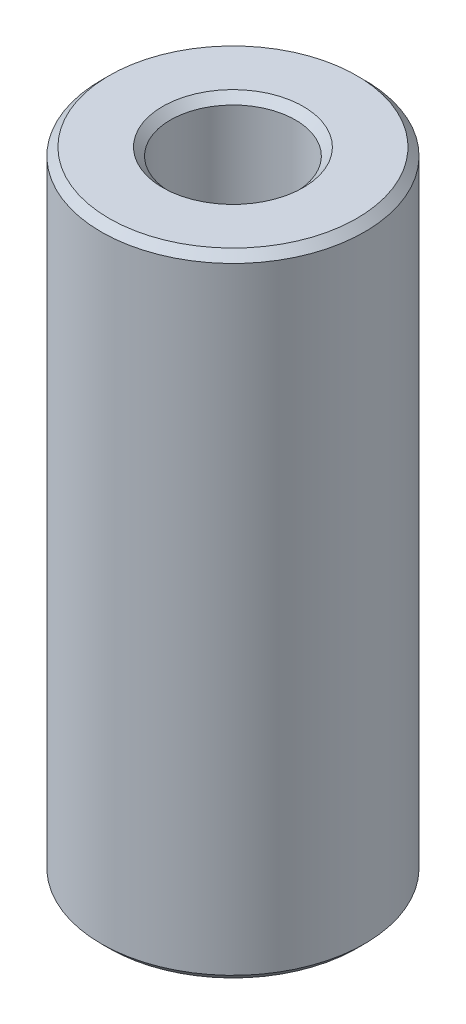
ISO-10303-21;
HEADER;
FILE_DESCRIPTION(('STEP AP214'),'2;1');
FILE_NAME('part.step','',(''),(''),'','','');
FILE_SCHEMA(('AUTOMOTIVE_DESIGN { 1 0 10303 214 1 1 1 1 }'));
ENDSEC;
DATA;
#1=APPLICATION_CONTEXT('core data for automotive mechanical design processes');
#2=APPLICATION_PROTOCOL_DEFINITION('international standard','automotive_design',2000,#1);
#3=PRODUCT_CONTEXT('',#1,'mechanical');
#4=PRODUCT('Part','Part','',(#3));
#5=PRODUCT_RELATED_PRODUCT_CATEGORY('part','',(#4));
#6=PRODUCT_DEFINITION_FORMATION('','',#4);
#7=PRODUCT_DEFINITION_CONTEXT('part definition',#1,'design');
#8=PRODUCT_DEFINITION('design','',#6,#7);
#9=PRODUCT_DEFINITION_SHAPE('','',#8);
#10=(LENGTH_UNIT() NAMED_UNIT(*) SI_UNIT(.MILLI.,.METRE.));
#11=(NAMED_UNIT(*) PLANE_ANGLE_UNIT() SI_UNIT($,.RADIAN.));
#12=(NAMED_UNIT(*) SI_UNIT($,.STERADIAN.) SOLID_ANGLE_UNIT());
#13=UNCERTAINTY_MEASURE_WITH_UNIT(LENGTH_MEASURE(1.E-05),#10,'distance_accuracy_value','');
#14=(GEOMETRIC_REPRESENTATION_CONTEXT(3) GLOBAL_UNCERTAINTY_ASSIGNED_CONTEXT((#13)) GLOBAL_UNIT_ASSIGNED_CONTEXT((#10,
#11,#12)) REPRESENTATION_CONTEXT('',''));
#15=CARTESIAN_POINT('',(0.,0.,0.));
#16=DIRECTION('',(0.,0.,1.));
#17=DIRECTION('',(1.,0.,0.));
#18=AXIS2_PLACEMENT_3D('',#15,#16,#17);
#19=CARTESIAN_POINT('',(0.,252.163192354526,0.));
#20=DIRECTION('',(0.,-1.,0.));
#21=DIRECTION('',(0.,0.,-1.));
#22=AXIS2_PLACEMENT_3D('',#19,#20,#21);
#23=CYLINDRICAL_SURFACE('',#22,52.5);
#24=CARTESIAN_POINT('',(0.,3.11576420458826,0.));
#25=DIRECTION('',(0.,1.,0.));
#26=DIRECTION('',(0.,0.,1.));
#27=AXIS2_PLACEMENT_3D('',#24,#25,#26);
#28=CIRCLE('',#27,52.5);
#29=CARTESIAN_POINT('',(0.,3.11576420458826,52.5));
#30=VERTEX_POINT('',#29);
#31=EDGE_CURVE('E10',#30,#30,#28,.T.);
#32=ORIENTED_EDGE('',*,*,#31,.T.);
#33=EDGE_LOOP('',(#32));
#34=FACE_BOUND('',#33,.T.);
#35=CARTESIAN_POINT('',(0.,249.047428149937,0.));
#36=DIRECTION('',(0.,1.,0.));
#37=DIRECTION('',(0.,0.,1.));
#38=AXIS2_PLACEMENT_3D('',#35,#36,#37);
#39=CIRCLE('',#38,52.5);
#40=CARTESIAN_POINT('',(0.,249.047428149937,52.5));
#41=VERTEX_POINT('',#40);
#42=EDGE_CURVE('E50',#41,#41,#39,.F.);
#43=ORIENTED_EDGE('',*,*,#42,.T.);
#44=EDGE_LOOP('',(#43));
#45=FACE_BOUND('',#44,.T.);
#46=ADVANCED_FACE('F39',(#34,#45),#23,.T.);
#47=CARTESIAN_POINT('',(0.,252.163192354526,0.));
#48=DIRECTION('',(0.,1.,0.));
#49=DIRECTION('',(0.,0.,1.));
#50=AXIS2_PLACEMENT_3D('',#47,#48,#49);
#51=PLANE('',#50);
#52=CARTESIAN_POINT('',(0.,252.163192354526,0.));
#53=DIRECTION('',(0.,1.,0.));
#54=DIRECTION('',(0.,0.,1.));
#55=AXIS2_PLACEMENT_3D('',#52,#53,#54);
#56=CIRCLE('',#55,28.0629586832944);
#57=CARTESIAN_POINT('',(0.,252.163192354526,28.0629586832944));
#58=VERTEX_POINT('',#57);
#59=EDGE_CURVE('E58',#58,#58,#56,.F.);
#60=ORIENTED_EDGE('',*,*,#59,.T.);
#61=EDGE_LOOP('',(#60));
#62=FACE_BOUND('',#61,.T.);
#63=CARTESIAN_POINT('',(0.,252.163192354526,0.));
#64=DIRECTION('',(0.,1.,0.));
#65=DIRECTION('',(0.,0.,1.));
#66=AXIS2_PLACEMENT_3D('',#63,#64,#65);
#67=CIRCLE('',#66,49.3842357954117);
#68=CARTESIAN_POINT('',(0.,252.163192354526,49.3842357954117));
#69=VERTEX_POINT('',#68);
#70=EDGE_CURVE('E61',#69,#69,#67,.T.);
#71=ORIENTED_EDGE('',*,*,#70,.T.);
#72=EDGE_LOOP('',(#71));
#73=FACE_BOUND('',#72,.T.);
#74=ADVANCED_FACE('F88',(#62,#73),#51,.T.);
#75=CARTESIAN_POINT('',(0.,0.,0.));
#76=DIRECTION('',(0.,1.,0.));
#77=DIRECTION('',(0.,0.,1.));
#78=AXIS2_PLACEMENT_3D('',#75,#76,#77);
#79=PLANE('',#78);
#80=CARTESIAN_POINT('',(0.,0.,0.));
#81=DIRECTION('',(0.,1.,0.));
#82=DIRECTION('',(0.,0.,1.));
#83=AXIS2_PLACEMENT_3D('',#80,#81,#82);
#84=CIRCLE('',#83,28.0629586832944);
#85=CARTESIAN_POINT('',(0.,0.,28.0629586832944));
#86=VERTEX_POINT('',#85);
#87=EDGE_CURVE('E51',#86,#86,#84,.T.);
#88=ORIENTED_EDGE('',*,*,#87,.T.);
#89=EDGE_LOOP('',(#88));
#90=FACE_BOUND('',#89,.T.);
#91=CARTESIAN_POINT('',(0.,0.,0.));
#92=DIRECTION('',(0.,1.,0.));
#93=DIRECTION('',(0.,0.,1.));
#94=AXIS2_PLACEMENT_3D('',#91,#92,#93);
#95=CIRCLE('',#94,49.3842357954117);
#96=CARTESIAN_POINT('',(0.,0.,49.3842357954117));
#97=VERTEX_POINT('',#96);
#98=EDGE_CURVE('E54',#97,#97,#95,.F.);
#99=ORIENTED_EDGE('',*,*,#98,.T.);
#100=EDGE_LOOP('',(#99));
#101=FACE_BOUND('',#100,.T.);
#102=ADVANCED_FACE('F83',(#90,#101),#79,.F.);
#103=CARTESIAN_POINT('',(0.,252.163192354526,0.));
#104=DIRECTION('',(0.,-1.,0.));
#105=DIRECTION('',(0.,0.,-1.));
#106=AXIS2_PLACEMENT_3D('',#103,#104,#105);
#107=CYLINDRICAL_SURFACE('',#106,24.9471944787061);
#108=CARTESIAN_POINT('',(0.,249.047428149937,0.));
#109=DIRECTION('',(0.,1.,0.));
#110=DIRECTION('',(0.,0.,1.));
#111=AXIS2_PLACEMENT_3D('',#108,#109,#110);
#112=CIRCLE('',#111,24.9471944787061);
#113=CARTESIAN_POINT('',(0.,249.047428149937,24.9471944787061));
#114=VERTEX_POINT('',#113);
#115=EDGE_CURVE('E67',#114,#114,#112,.T.);
#116=ORIENTED_EDGE('',*,*,#115,.T.);
#117=EDGE_LOOP('',(#116));
#118=FACE_BOUND('',#117,.T.);
#119=CARTESIAN_POINT('',(0.,3.11576420458831,0.));
#120=DIRECTION('',(0.,1.,0.));
#121=DIRECTION('',(0.,0.,1.));
#122=AXIS2_PLACEMENT_3D('',#119,#120,#121);
#123=CIRCLE('',#122,24.9471944787061);
#124=CARTESIAN_POINT('',(0.,3.11576420458831,24.9471944787061));
#125=VERTEX_POINT('',#124);
#126=EDGE_CURVE('E69',#125,#125,#123,.F.);
#127=ORIENTED_EDGE('',*,*,#126,.T.);
#128=EDGE_LOOP('',(#127));
#129=FACE_BOUND('',#128,.T.);
#130=ADVANCED_FACE('F71',(#118,#129),#107,.F.);
#131=CARTESIAN_POINT('',(0.,249.047428149937,0.));
#132=DIRECTION('',(0.,1.,0.));
#133=DIRECTION('',(0.,0.,1.));
#134=AXIS2_PLACEMENT_3D('',#131,#132,#133);
#135=CONICAL_SURFACE('',#134,24.9471944787061,0.78539816339745);
#136=ORIENTED_EDGE('',*,*,#59,.F.);
#137=EDGE_LOOP('',(#136));
#138=FACE_BOUND('',#137,.T.);
#139=ORIENTED_EDGE('',*,*,#115,.F.);
#140=EDGE_LOOP('',(#139));
#141=FACE_BOUND('',#140,.T.);
#142=ADVANCED_FACE('F77',(#138,#141),#135,.F.);
#143=CARTESIAN_POINT('',(0.,0.,0.));
#144=DIRECTION('',(0.,-1.,0.));
#145=DIRECTION('',(0.,0.,-1.));
#146=AXIS2_PLACEMENT_3D('',#143,#144,#145);
#147=CONICAL_SURFACE('',#146,28.0629586832944,0.785398163397446);
#148=ORIENTED_EDGE('',*,*,#126,.F.);
#149=EDGE_LOOP('',(#148));
#150=FACE_BOUND('',#149,.T.);
#151=ORIENTED_EDGE('',*,*,#87,.F.);
#152=EDGE_LOOP('',(#151));
#153=FACE_BOUND('',#152,.T.);
#154=ADVANCED_FACE('F73',(#150,#153),#147,.F.);
#155=CARTESIAN_POINT('',(0.,3.11576420458826,0.));
#156=DIRECTION('',(0.,1.,0.));
#157=DIRECTION('',(0.,0.,1.));
#158=AXIS2_PLACEMENT_3D('',#155,#156,#157);
#159=CONICAL_SURFACE('',#158,52.5,0.785398163397449);
#160=ORIENTED_EDGE('',*,*,#98,.F.);
#161=EDGE_LOOP('',(#160));
#162=FACE_BOUND('',#161,.T.);
#163=ORIENTED_EDGE('',*,*,#31,.F.);
#164=EDGE_LOOP('',(#163));
#165=FACE_BOUND('',#164,.T.);
#166=ADVANCED_FACE('F76',(#162,#165),#159,.T.);
#167=CARTESIAN_POINT('',(0.,252.163192354526,0.));
#168=DIRECTION('',(0.,-1.,0.));
#169=DIRECTION('',(0.,0.,-1.));
#170=AXIS2_PLACEMENT_3D('',#167,#168,#169);
#171=CONICAL_SURFACE('',#170,49.3842357954117,0.785398163397445);
#172=ORIENTED_EDGE('',*,*,#42,.F.);
#173=EDGE_LOOP('',(#172));
#174=FACE_BOUND('',#173,.T.);
#175=ORIENTED_EDGE('',*,*,#70,.F.);
#176=EDGE_LOOP('',(#175));
#177=FACE_BOUND('',#176,.T.);
#178=ADVANCED_FACE('F45',(#174,#177),#171,.T.);
#179=CLOSED_SHELL('',(#46,#74,#102,#130,#142,#154,#166,#178));
#180=MANIFOLD_SOLID_BREP('B2',#179);
#181=ADVANCED_BREP_SHAPE_REPRESENTATION('',(#18,#180),#14);
#182=SHAPE_DEFINITION_REPRESENTATION(#9,#181);
ENDSEC;
END-ISO-10303-21;
